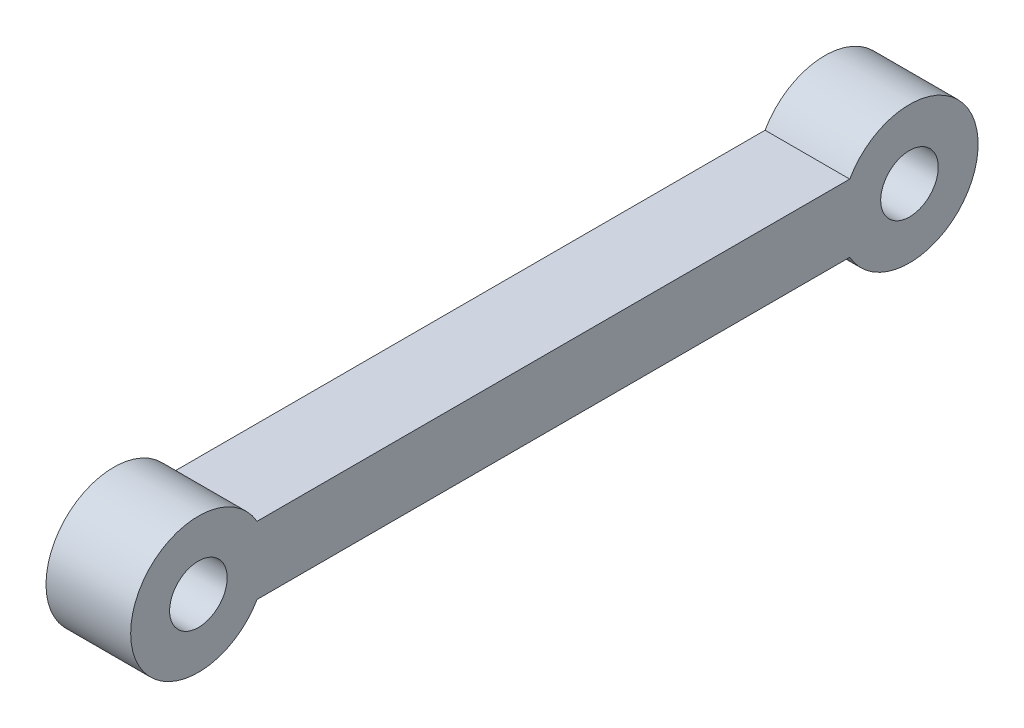
ISO-10303-21;
HEADER;
FILE_DESCRIPTION(('STEP AP214'),'2;1');
FILE_NAME('part.step','',(''),(''),'','','');
FILE_SCHEMA(('AUTOMOTIVE_DESIGN { 1 0 10303 214 1 1 1 1 }'));
ENDSEC;
DATA;
#1=APPLICATION_CONTEXT('core data for automotive mechanical design processes');
#2=APPLICATION_PROTOCOL_DEFINITION('international standard','automotive_design',2000,#1);
#3=PRODUCT_CONTEXT('',#1,'mechanical');
#4=PRODUCT('Part','Part','',(#3));
#5=PRODUCT_RELATED_PRODUCT_CATEGORY('part','',(#4));
#6=PRODUCT_DEFINITION_FORMATION('','',#4);
#7=PRODUCT_DEFINITION_CONTEXT('part definition',#1,'design');
#8=PRODUCT_DEFINITION('design','',#6,#7);
#9=PRODUCT_DEFINITION_SHAPE('','',#8);
#10=(LENGTH_UNIT() NAMED_UNIT(*) SI_UNIT(.MILLI.,.METRE.));
#11=(NAMED_UNIT(*) PLANE_ANGLE_UNIT() SI_UNIT($,.RADIAN.));
#12=(NAMED_UNIT(*) SI_UNIT($,.STERADIAN.) SOLID_ANGLE_UNIT());
#13=UNCERTAINTY_MEASURE_WITH_UNIT(LENGTH_MEASURE(1.E-05),#10,'distance_accuracy_value','');
#14=(GEOMETRIC_REPRESENTATION_CONTEXT(3) GLOBAL_UNCERTAINTY_ASSIGNED_CONTEXT((#13)) GLOBAL_UNIT_ASSIGNED_CONTEXT((#10,
#11,#12)) REPRESENTATION_CONTEXT('',''));
#15=CARTESIAN_POINT('',(0.,0.,0.));
#16=DIRECTION('',(0.,0.,1.));
#17=DIRECTION('',(1.,0.,0.));
#18=AXIS2_PLACEMENT_3D('',#15,#16,#17);
#19=CARTESIAN_POINT('',(-4.24183995253687,57.8148352823744,-44.0592946166173));
#20=DIRECTION('',(-1.,0.,0.));
#21=DIRECTION('',(0.,-1.,0.));
#22=AXIS2_PLACEMENT_3D('',#19,#20,#21);
#23=PLANE('',#22);
#24=CARTESIAN_POINT('',(-4.24183995253686,57.8148352823744,-2.06772577980338));
#25=DIRECTION('',(-1.,0.,0.));
#26=DIRECTION('',(0.,-1.,0.));
#27=AXIS2_PLACEMENT_3D('',#24,#25,#26);
#28=CIRCLE('',#27,1.7);
#29=CARTESIAN_POINT('',(-4.24183995253686,56.1148352823744,-2.06772577980338));
#30=VERTEX_POINT('',#29);
#31=EDGE_CURVE('E108',#30,#30,#28,.T.);
#32=ORIENTED_EDGE('',*,*,#31,.F.);
#33=EDGE_LOOP('',(#32));
#34=FACE_BOUND('',#33,.T.);
#35=CARTESIAN_POINT('',(-4.24183995253687,57.8148352823744,-44.0592946166173));
#36=DIRECTION('',(-1.,0.,0.));
#37=DIRECTION('',(0.,-1.,0.));
#38=AXIS2_PLACEMENT_3D('',#35,#36,#37);
#39=CIRCLE('',#38,4.055);
#40=CARTESIAN_POINT('',(-4.24183995253687,59.8148352823744,-40.5318273949411));
#41=VERTEX_POINT('',#40);
#42=CARTESIAN_POINT('',(-4.24183995253687,55.8148352823744,-40.5318273949411));
#43=VERTEX_POINT('',#42);
#44=EDGE_CURVE('E93',#41,#43,#39,.T.);
#45=ORIENTED_EDGE('',*,*,#44,.T.);
#46=DIRECTION('',(0.,0.,1.));
#47=VECTOR('',#46,1.);
#48=CARTESIAN_POINT('',(-4.24183995253687,55.8148352823744,-40.5318273949411));
#49=LINE('',#48,#47);
#50=CARTESIAN_POINT('',(-4.24183995253686,55.8148352823744,-5.53182739494112));
#51=VERTEX_POINT('',#50);
#52=EDGE_CURVE('E88',#43,#51,#49,.T.);
#53=ORIENTED_EDGE('',*,*,#52,.T.);
#54=CARTESIAN_POINT('',(-4.24183995253686,57.8148352823744,-2.06772577980338));
#55=DIRECTION('',(-1.,0.,0.));
#56=DIRECTION('',(0.,-1.,0.));
#57=AXIS2_PLACEMENT_3D('',#54,#55,#56);
#58=CIRCLE('',#57,4.);
#59=CARTESIAN_POINT('',(-4.24183995253686,59.8148352823745,-5.53182739494113));
#60=VERTEX_POINT('',#59);
#61=EDGE_CURVE('E91',#51,#60,#58,.T.);
#62=ORIENTED_EDGE('',*,*,#61,.T.);
#63=DIRECTION('',(0.,0.,-1.));
#64=VECTOR('',#63,1.);
#65=CARTESIAN_POINT('',(-4.24183995253687,59.8148352823744,-40.5318273949411));
#66=LINE('',#65,#64);
#67=EDGE_CURVE('E58',#60,#41,#66,.T.);
#68=ORIENTED_EDGE('',*,*,#67,.T.);
#69=EDGE_LOOP('',(#45,#53,#62,#68));
#70=FACE_BOUND('',#69,.T.);
#71=CARTESIAN_POINT('',(-4.24183995253687,57.8148352823744,-44.0592946166173));
#72=DIRECTION('',(-1.,0.,0.));
#73=DIRECTION('',(0.,-1.,0.));
#74=AXIS2_PLACEMENT_3D('',#71,#72,#73);
#75=CIRCLE('',#74,1.7);
#76=CARTESIAN_POINT('',(-4.24183995253687,56.1148352823744,-44.0592946166173));
#77=VERTEX_POINT('',#76);
#78=EDGE_CURVE('E123',#77,#77,#75,.T.);
#79=ORIENTED_EDGE('',*,*,#78,.F.);
#80=EDGE_LOOP('',(#79));
#81=FACE_BOUND('',#80,.T.);
#82=ADVANCED_FACE('F41',(#34,#70,#81),#23,.T.);
#83=CARTESIAN_POINT('',(0.758160047463132,57.8148352823744,-44.0592946166173));
#84=DIRECTION('',(-1.,0.,0.));
#85=DIRECTION('',(0.,-1.,0.));
#86=AXIS2_PLACEMENT_3D('',#83,#84,#85);
#87=PLANE('',#86);
#88=CARTESIAN_POINT('',(0.758160047463132,57.8148352823744,-44.0592946166173));
#89=DIRECTION('',(-1.,0.,0.));
#90=DIRECTION('',(0.,-1.,0.));
#91=AXIS2_PLACEMENT_3D('',#88,#89,#90);
#92=CIRCLE('',#91,4.055);
#93=CARTESIAN_POINT('',(0.758160047463134,59.8148352823744,-40.5318273949411));
#94=VERTEX_POINT('',#93);
#95=CARTESIAN_POINT('',(0.758160047463132,55.8148352823744,-40.5318273949411));
#96=VERTEX_POINT('',#95);
#97=EDGE_CURVE('E105',#94,#96,#92,.T.);
#98=ORIENTED_EDGE('',*,*,#97,.F.);
#99=DIRECTION('',(0.,0.,-1.));
#100=VECTOR('',#99,1.);
#101=CARTESIAN_POINT('',(0.758160047463134,59.8148352823744,-40.5318273949411));
#102=LINE('',#101,#100);
#103=CARTESIAN_POINT('',(0.758160047463142,59.8148352823745,-5.53182739494113));
#104=VERTEX_POINT('',#103);
#105=EDGE_CURVE('E81',#104,#94,#102,.T.);
#106=ORIENTED_EDGE('',*,*,#105,.F.);
#107=CARTESIAN_POINT('',(0.758160047463141,57.8148352823744,-2.06772577980338));
#108=DIRECTION('',(-1.,0.,0.));
#109=DIRECTION('',(0.,-1.,0.));
#110=AXIS2_PLACEMENT_3D('',#107,#108,#109);
#111=CIRCLE('',#110,4.);
#112=CARTESIAN_POINT('',(0.758160047463139,55.8148352823744,-5.53182739494113));
#113=VERTEX_POINT('',#112);
#114=EDGE_CURVE('E75',#113,#104,#111,.T.);
#115=ORIENTED_EDGE('',*,*,#114,.F.);
#116=DIRECTION('',(0.,0.,1.));
#117=VECTOR('',#116,1.);
#118=CARTESIAN_POINT('',(0.758160047463132,55.8148352823744,-40.5318273949411));
#119=LINE('',#118,#117);
#120=EDGE_CURVE('E97',#96,#113,#119,.T.);
#121=ORIENTED_EDGE('',*,*,#120,.F.);
#122=EDGE_LOOP('',(#98,#106,#115,#121));
#123=FACE_BOUND('',#122,.T.);
#124=CARTESIAN_POINT('',(0.758160047463141,57.8148352823744,-2.06772577980338));
#125=DIRECTION('',(-1.,0.,0.));
#126=DIRECTION('',(0.,-1.,0.));
#127=AXIS2_PLACEMENT_3D('',#124,#125,#126);
#128=CIRCLE('',#127,1.7);
#129=CARTESIAN_POINT('',(0.75816004746314,56.1148352823744,-2.06772577980338));
#130=VERTEX_POINT('',#129);
#131=EDGE_CURVE('E120',#130,#130,#128,.T.);
#132=ORIENTED_EDGE('',*,*,#131,.T.);
#133=EDGE_LOOP('',(#132));
#134=FACE_BOUND('',#133,.T.);
#135=CARTESIAN_POINT('',(0.758160047463132,57.8148352823744,-44.0592946166173));
#136=DIRECTION('',(-1.,0.,0.));
#137=DIRECTION('',(0.,-1.,0.));
#138=AXIS2_PLACEMENT_3D('',#135,#136,#137);
#139=CIRCLE('',#138,1.7);
#140=CARTESIAN_POINT('',(0.758160047463131,56.1148352823744,-44.0592946166173));
#141=VERTEX_POINT('',#140);
#142=EDGE_CURVE('E126',#141,#141,#139,.T.);
#143=ORIENTED_EDGE('',*,*,#142,.T.);
#144=EDGE_LOOP('',(#143));
#145=FACE_BOUND('',#144,.T.);
#146=ADVANCED_FACE('F116',(#123,#134,#145),#87,.F.);
#147=CARTESIAN_POINT('',(-4.24183995253687,57.8148352823744,-44.0592946166173));
#148=DIRECTION('',(1.,0.,0.));
#149=DIRECTION('',(0.,1.,0.));
#150=AXIS2_PLACEMENT_3D('',#147,#148,#149);
#151=CYLINDRICAL_SURFACE('',#150,4.055);
#152=ORIENTED_EDGE('',*,*,#97,.T.);
#153=DIRECTION('',(1.,0.,0.));
#154=VECTOR('',#153,1.);
#155=CARTESIAN_POINT('',(-4.24183995253687,55.8148352823744,-40.5318273949411));
#156=LINE('',#155,#154);
#157=EDGE_CURVE('E11',#43,#96,#156,.T.);
#158=ORIENTED_EDGE('',*,*,#157,.F.);
#159=ORIENTED_EDGE('',*,*,#44,.F.);
#160=DIRECTION('',(1.,0.,0.));
#161=VECTOR('',#160,1.);
#162=CARTESIAN_POINT('',(-4.24183995253687,59.8148352823744,-40.5318273949411));
#163=LINE('',#162,#161);
#164=EDGE_CURVE('E101',#41,#94,#163,.T.);
#165=ORIENTED_EDGE('',*,*,#164,.T.);
#166=EDGE_LOOP('',(#152,#158,#159,#165));
#167=FACE_BOUND('',#166,.T.);
#168=ADVANCED_FACE('F43',(#167),#151,.T.);
#169=CARTESIAN_POINT('',(-4.24183995253687,55.8148352823744,-40.5318273949411));
#170=DIRECTION('',(0.,1.,0.));
#171=DIRECTION('',(-1.,0.,0.));
#172=AXIS2_PLACEMENT_3D('',#169,#170,#171);
#173=PLANE('',#172);
#174=ORIENTED_EDGE('',*,*,#120,.T.);
#175=DIRECTION('',(1.,0.,0.));
#176=VECTOR('',#175,1.);
#177=CARTESIAN_POINT('',(-4.24183995253686,55.8148352823744,-5.53182739494112));
#178=LINE('',#177,#176);
#179=EDGE_CURVE('E50',#51,#113,#178,.T.);
#180=ORIENTED_EDGE('',*,*,#179,.F.);
#181=ORIENTED_EDGE('',*,*,#52,.F.);
#182=ORIENTED_EDGE('',*,*,#157,.T.);
#183=EDGE_LOOP('',(#174,#180,#181,#182));
#184=FACE_BOUND('',#183,.T.);
#185=ADVANCED_FACE('F96',(#184),#173,.F.);
#186=CARTESIAN_POINT('',(-4.24183995253686,57.8148352823744,-2.06772577980338));
#187=DIRECTION('',(1.,0.,0.));
#188=DIRECTION('',(0.,1.,0.));
#189=AXIS2_PLACEMENT_3D('',#186,#187,#188);
#190=CYLINDRICAL_SURFACE('',#189,4.);
#191=ORIENTED_EDGE('',*,*,#114,.T.);
#192=DIRECTION('',(1.,0.,0.));
#193=VECTOR('',#192,1.);
#194=CARTESIAN_POINT('',(-4.24183995253686,59.8148352823745,-5.53182739494113));
#195=LINE('',#194,#193);
#196=EDGE_CURVE('E98',#60,#104,#195,.T.);
#197=ORIENTED_EDGE('',*,*,#196,.F.);
#198=ORIENTED_EDGE('',*,*,#61,.F.);
#199=ORIENTED_EDGE('',*,*,#179,.T.);
#200=EDGE_LOOP('',(#191,#197,#198,#199));
#201=FACE_BOUND('',#200,.T.);
#202=ADVANCED_FACE('F99',(#201),#190,.T.);
#203=CARTESIAN_POINT('',(-4.24183995253687,59.8148352823744,-40.5318273949411));
#204=DIRECTION('',(0.,-1.,0.));
#205=DIRECTION('',(1.,0.,0.));
#206=AXIS2_PLACEMENT_3D('',#203,#204,#205);
#207=PLANE('',#206);
#208=ORIENTED_EDGE('',*,*,#105,.T.);
#209=ORIENTED_EDGE('',*,*,#164,.F.);
#210=ORIENTED_EDGE('',*,*,#67,.F.);
#211=ORIENTED_EDGE('',*,*,#196,.T.);
#212=EDGE_LOOP('',(#208,#209,#210,#211));
#213=FACE_BOUND('',#212,.T.);
#214=ADVANCED_FACE('F113',(#213),#207,.F.);
#215=CARTESIAN_POINT('',(-4.24183995253686,57.8148352823744,-2.06772577980338));
#216=DIRECTION('',(1.,0.,0.));
#217=DIRECTION('',(0.,1.,0.));
#218=AXIS2_PLACEMENT_3D('',#215,#216,#217);
#219=CYLINDRICAL_SURFACE('',#218,1.7);
#220=ORIENTED_EDGE('',*,*,#31,.T.);
#221=EDGE_LOOP('',(#220));
#222=FACE_BOUND('',#221,.T.);
#223=ORIENTED_EDGE('',*,*,#131,.F.);
#224=EDGE_LOOP('',(#223));
#225=FACE_BOUND('',#224,.T.);
#226=ADVANCED_FACE('F143',(#222,#225),#219,.F.);
#227=CARTESIAN_POINT('',(-4.24183995253687,57.8148352823744,-44.0592946166173));
#228=DIRECTION('',(1.,0.,0.));
#229=DIRECTION('',(0.,1.,0.));
#230=AXIS2_PLACEMENT_3D('',#227,#228,#229);
#231=CYLINDRICAL_SURFACE('',#230,1.7);
#232=ORIENTED_EDGE('',*,*,#78,.T.);
#233=EDGE_LOOP('',(#232));
#234=FACE_BOUND('',#233,.T.);
#235=ORIENTED_EDGE('',*,*,#142,.F.);
#236=EDGE_LOOP('',(#235));
#237=FACE_BOUND('',#236,.T.);
#238=ADVANCED_FACE('F132',(#234,#237),#231,.F.);
#239=CLOSED_SHELL('',(#82,#146,#168,#185,#202,#214,#226,#238));
#240=MANIFOLD_SOLID_BREP('B2',#239);
#241=ADVANCED_BREP_SHAPE_REPRESENTATION('',(#18,#240),#14);
#242=SHAPE_DEFINITION_REPRESENTATION(#9,#241);
ENDSEC;
END-ISO-10303-21;
